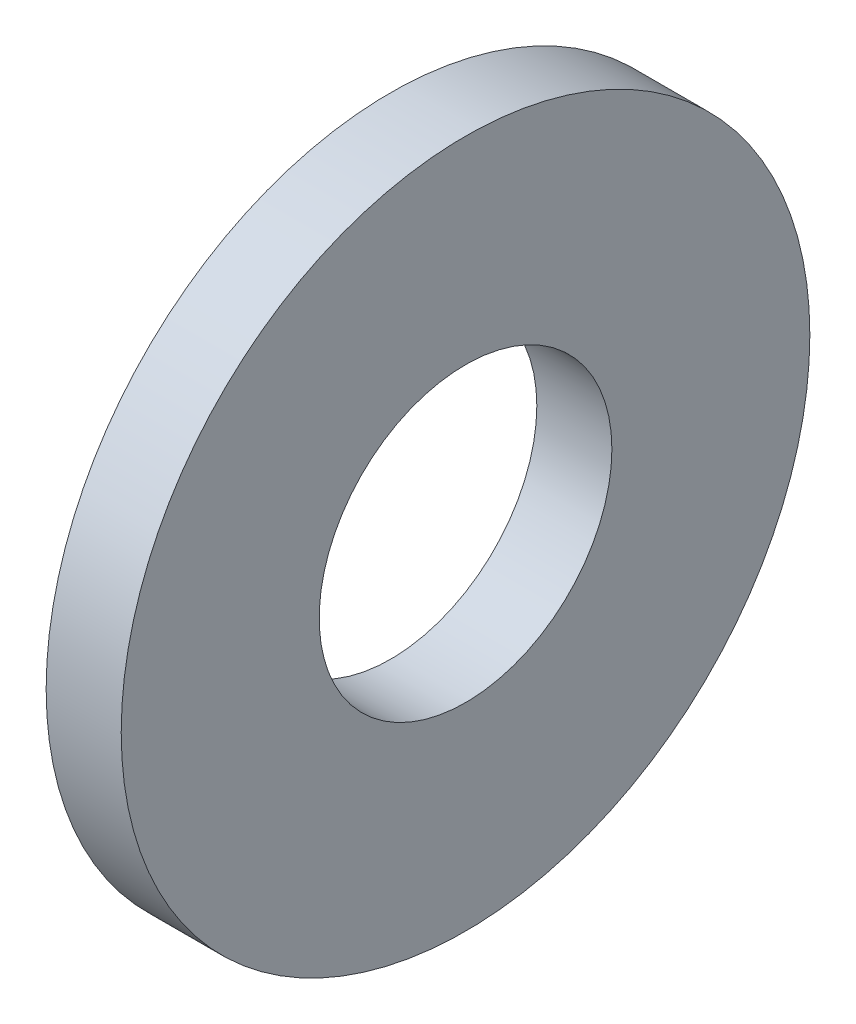
ISO-10303-21;
HEADER;
FILE_DESCRIPTION(('STEP AP214'),'2;1');
FILE_NAME('part.step','',(''),(''),'','','');
FILE_SCHEMA(('AUTOMOTIVE_DESIGN { 1 0 10303 214 1 1 1 1 }'));
ENDSEC;
DATA;
#1=APPLICATION_CONTEXT('core data for automotive mechanical design processes');
#2=APPLICATION_PROTOCOL_DEFINITION('international standard','automotive_design',2000,#1);
#3=PRODUCT_CONTEXT('',#1,'mechanical');
#4=PRODUCT('Part','Part','',(#3));
#5=PRODUCT_RELATED_PRODUCT_CATEGORY('part','',(#4));
#6=PRODUCT_DEFINITION_FORMATION('','',#4);
#7=PRODUCT_DEFINITION_CONTEXT('part definition',#1,'design');
#8=PRODUCT_DEFINITION('design','',#6,#7);
#9=PRODUCT_DEFINITION_SHAPE('','',#8);
#10=(LENGTH_UNIT() NAMED_UNIT(*) SI_UNIT(.MILLI.,.METRE.));
#11=(NAMED_UNIT(*) PLANE_ANGLE_UNIT() SI_UNIT($,.RADIAN.));
#12=(NAMED_UNIT(*) SI_UNIT($,.STERADIAN.) SOLID_ANGLE_UNIT());
#13=UNCERTAINTY_MEASURE_WITH_UNIT(LENGTH_MEASURE(1.E-05),#10,'distance_accuracy_value','');
#14=(GEOMETRIC_REPRESENTATION_CONTEXT(3) GLOBAL_UNCERTAINTY_ASSIGNED_CONTEXT((#13)) GLOBAL_UNIT_ASSIGNED_CONTEXT((#10,
#11,#12)) REPRESENTATION_CONTEXT('',''));
#15=CARTESIAN_POINT('',(0.,0.,0.));
#16=DIRECTION('',(0.,0.,1.));
#17=DIRECTION('',(1.,0.,0.));
#18=AXIS2_PLACEMENT_3D('',#15,#16,#17);
#19=CARTESIAN_POINT('',(2.032,0.,0.));
#20=DIRECTION('',(1.,0.,0.));
#21=DIRECTION('',(0.,0.,-1.));
#22=AXIS2_PLACEMENT_3D('',#19,#20,#21);
#23=PLANE('',#22);
#24=CARTESIAN_POINT('',(2.032,0.,0.));
#25=DIRECTION('',(1.,0.,0.));
#26=DIRECTION('',(0.,0.,-1.));
#27=AXIS2_PLACEMENT_3D('',#24,#25,#26);
#28=CIRCLE('',#27,9.3218);
#29=CARTESIAN_POINT('',(2.032,0.,-9.3218));
#30=VERTEX_POINT('',#29);
#31=EDGE_CURVE('E10',#30,#30,#28,.T.);
#32=ORIENTED_EDGE('',*,*,#31,.T.);
#33=EDGE_LOOP('',(#32));
#34=FACE_BOUND('',#33,.T.);
#35=CARTESIAN_POINT('',(2.032,0.,0.));
#36=DIRECTION('',(1.,0.,0.));
#37=DIRECTION('',(0.,0.,-1.));
#38=AXIS2_PLACEMENT_3D('',#35,#36,#37);
#39=CIRCLE('',#38,3.9624);
#40=CARTESIAN_POINT('',(2.032,0.,-3.9624));
#41=VERTEX_POINT('',#40);
#42=EDGE_CURVE('E41',#41,#41,#39,.T.);
#43=ORIENTED_EDGE('',*,*,#42,.F.);
#44=EDGE_LOOP('',(#43));
#45=FACE_BOUND('',#44,.T.);
#46=ADVANCED_FACE('F30',(#34,#45),#23,.T.);
#47=CARTESIAN_POINT('',(0.,0.,0.));
#48=DIRECTION('',(1.,0.,0.));
#49=DIRECTION('',(0.,0.,-1.));
#50=AXIS2_PLACEMENT_3D('',#47,#48,#49);
#51=PLANE('',#50);
#52=CARTESIAN_POINT('',(0.,0.,0.));
#53=DIRECTION('',(1.,0.,0.));
#54=DIRECTION('',(0.,0.,-1.));
#55=AXIS2_PLACEMENT_3D('',#52,#53,#54);
#56=CIRCLE('',#55,9.3218);
#57=CARTESIAN_POINT('',(0.,0.,-9.3218));
#58=VERTEX_POINT('',#57);
#59=EDGE_CURVE('E34',#58,#58,#56,.T.);
#60=ORIENTED_EDGE('',*,*,#59,.F.);
#61=EDGE_LOOP('',(#60));
#62=FACE_BOUND('',#61,.T.);
#63=CARTESIAN_POINT('',(0.,0.,0.));
#64=DIRECTION('',(1.,0.,0.));
#65=DIRECTION('',(0.,0.,-1.));
#66=AXIS2_PLACEMENT_3D('',#63,#64,#65);
#67=CIRCLE('',#66,3.9624);
#68=CARTESIAN_POINT('',(0.,0.,-3.9624));
#69=VERTEX_POINT('',#68);
#70=EDGE_CURVE('E43',#69,#69,#67,.T.);
#71=ORIENTED_EDGE('',*,*,#70,.T.);
#72=EDGE_LOOP('',(#71));
#73=FACE_BOUND('',#72,.T.);
#74=ADVANCED_FACE('F53',(#62,#73),#51,.F.);
#75=CARTESIAN_POINT('',(2.032,0.,0.));
#76=DIRECTION('',(-1.,0.,0.));
#77=DIRECTION('',(0.,0.,1.));
#78=AXIS2_PLACEMENT_3D('',#75,#76,#77);
#79=CYLINDRICAL_SURFACE('',#78,9.3218);
#80=ORIENTED_EDGE('',*,*,#31,.F.);
#81=EDGE_LOOP('',(#80));
#82=FACE_BOUND('',#81,.T.);
#83=ORIENTED_EDGE('',*,*,#59,.T.);
#84=EDGE_LOOP('',(#83));
#85=FACE_BOUND('',#84,.T.);
#86=ADVANCED_FACE('F32',(#82,#85),#79,.T.);
#87=CARTESIAN_POINT('',(2.032,0.,0.));
#88=DIRECTION('',(-1.,0.,0.));
#89=DIRECTION('',(0.,0.,1.));
#90=AXIS2_PLACEMENT_3D('',#87,#88,#89);
#91=CYLINDRICAL_SURFACE('',#90,3.9624);
#92=ORIENTED_EDGE('',*,*,#42,.T.);
#93=EDGE_LOOP('',(#92));
#94=FACE_BOUND('',#93,.T.);
#95=ORIENTED_EDGE('',*,*,#70,.F.);
#96=EDGE_LOOP('',(#95));
#97=FACE_BOUND('',#96,.T.);
#98=ADVANCED_FACE('F49',(#94,#97),#91,.F.);
#99=CLOSED_SHELL('',(#46,#74,#86,#98));
#100=MANIFOLD_SOLID_BREP('B2',#99);
#101=ADVANCED_BREP_SHAPE_REPRESENTATION('',(#18,#100),#14);
#102=SHAPE_DEFINITION_REPRESENTATION(#9,#101);
ENDSEC;
END-ISO-10303-21;
